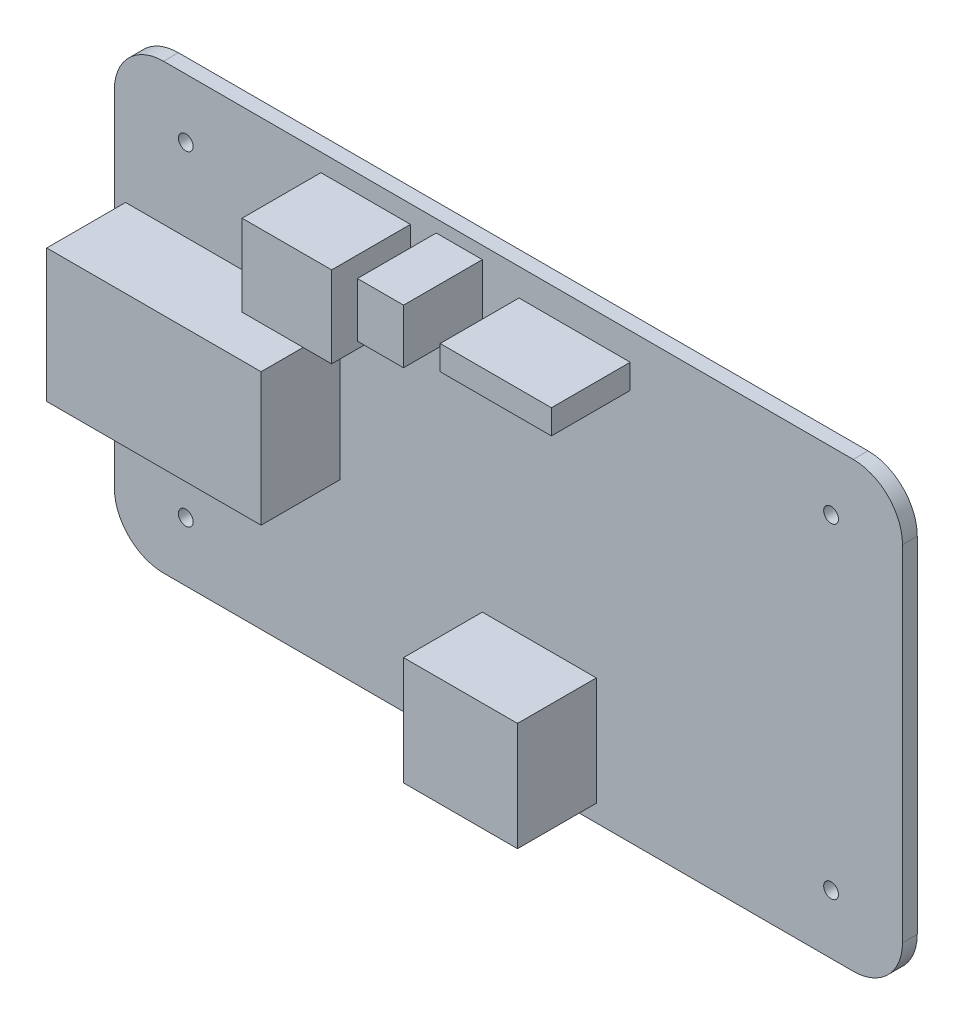
ISO-10303-21;
HEADER;
FILE_DESCRIPTION(('STEP AP214'),'2;1');
FILE_NAME('part.step','',(''),(''),'','','');
FILE_SCHEMA(('AUTOMOTIVE_DESIGN { 1 0 10303 214 1 1 1 1 }'));
ENDSEC;
DATA;
#1=APPLICATION_CONTEXT('core data for automotive mechanical design processes');
#2=APPLICATION_PROTOCOL_DEFINITION('international standard','automotive_design',2000,#1);
#3=PRODUCT_CONTEXT('',#1,'mechanical');
#4=PRODUCT('Part','Part','',(#3));
#5=PRODUCT_RELATED_PRODUCT_CATEGORY('part','',(#4));
#6=PRODUCT_DEFINITION_FORMATION('','',#4);
#7=PRODUCT_DEFINITION_CONTEXT('part definition',#1,'design');
#8=PRODUCT_DEFINITION('design','',#6,#7);
#9=PRODUCT_DEFINITION_SHAPE('','',#8);
#10=(LENGTH_UNIT() NAMED_UNIT(*) SI_UNIT(.MILLI.,.METRE.));
#11=(NAMED_UNIT(*) PLANE_ANGLE_UNIT() SI_UNIT($,.RADIAN.));
#12=(NAMED_UNIT(*) SI_UNIT($,.STERADIAN.) SOLID_ANGLE_UNIT());
#13=UNCERTAINTY_MEASURE_WITH_UNIT(LENGTH_MEASURE(1.E-05),#10,'distance_accuracy_value','');
#14=(GEOMETRIC_REPRESENTATION_CONTEXT(3) GLOBAL_UNCERTAINTY_ASSIGNED_CONTEXT((#13)) GLOBAL_UNIT_ASSIGNED_CONTEXT((#10,
#11,#12)) REPRESENTATION_CONTEXT('',''));
#15=CARTESIAN_POINT('',(0.,0.,0.));
#16=DIRECTION('',(0.,0.,1.));
#17=DIRECTION('',(1.,0.,0.));
#18=AXIS2_PLACEMENT_3D('',#15,#16,#17);
#19=CARTESIAN_POINT('',(0.,0.,3.));
#20=DIRECTION('',(0.,0.,1.));
#21=DIRECTION('',(1.,0.,0.));
#22=AXIS2_PLACEMENT_3D('',#19,#20,#21);
#23=PLANE('',#22);
#24=CARTESIAN_POINT('',(-65.5,-33.,3.));
#25=DIRECTION('',(0.,0.,1.));
#26=DIRECTION('',(1.,0.,0.));
#27=AXIS2_PLACEMENT_3D('',#24,#25,#26);
#28=CIRCLE('',#27,1.5);
#29=CARTESIAN_POINT('',(-64.,-33.,3.));
#30=VERTEX_POINT('',#29);
#31=EDGE_CURVE('E423',#30,#30,#28,.T.);
#32=ORIENTED_EDGE('',*,*,#31,.F.);
#33=EDGE_LOOP('',(#32));
#34=FACE_BOUND('',#33,.T.);
#35=CARTESIAN_POINT('',(65.5,-33.,3.));
#36=DIRECTION('',(0.,0.,1.));
#37=DIRECTION('',(1.,0.,0.));
#38=AXIS2_PLACEMENT_3D('',#35,#36,#37);
#39=CIRCLE('',#38,1.5);
#40=CARTESIAN_POINT('',(67.,-33.,3.));
#41=VERTEX_POINT('',#40);
#42=EDGE_CURVE('E437',#41,#41,#39,.T.);
#43=ORIENTED_EDGE('',*,*,#42,.F.);
#44=EDGE_LOOP('',(#43));
#45=FACE_BOUND('',#44,.T.);
#46=CARTESIAN_POINT('',(65.5,33.,3.));
#47=DIRECTION('',(0.,0.,1.));
#48=DIRECTION('',(1.,0.,0.));
#49=AXIS2_PLACEMENT_3D('',#46,#47,#48);
#50=CIRCLE('',#49,1.5);
#51=CARTESIAN_POINT('',(67.,33.,3.));
#52=VERTEX_POINT('',#51);
#53=EDGE_CURVE('E429',#52,#52,#50,.T.);
#54=ORIENTED_EDGE('',*,*,#53,.F.);
#55=EDGE_LOOP('',(#54));
#56=FACE_BOUND('',#55,.T.);
#57=CARTESIAN_POINT('',(-65.5,33.,3.));
#58=DIRECTION('',(0.,0.,1.));
#59=DIRECTION('',(1.,0.,0.));
#60=AXIS2_PLACEMENT_3D('',#57,#58,#59);
#61=CIRCLE('',#60,1.5);
#62=CARTESIAN_POINT('',(-64.,33.,3.));
#63=VERTEX_POINT('',#62);
#64=EDGE_CURVE('E428',#63,#63,#61,.T.);
#65=ORIENTED_EDGE('',*,*,#64,.F.);
#66=EDGE_LOOP('',(#65));
#67=FACE_BOUND('',#66,.T.);
#68=DIRECTION('',(0.,-1.,0.));
#69=VECTOR('',#68,1.);
#70=CARTESIAN_POINT('',(-80.,45.,3.));
#71=LINE('',#70,#69);
#72=CARTESIAN_POINT('',(-80.,35.,3.));
#73=VERTEX_POINT('',#72);
#74=CARTESIAN_POINT('',(-80.,-35.,3.));
#75=VERTEX_POINT('',#74);
#76=EDGE_CURVE('E465',#73,#75,#71,.T.);
#77=ORIENTED_EDGE('',*,*,#76,.T.);
#78=CARTESIAN_POINT('',(-70.,-35.,3.));
#79=DIRECTION('',(0.,0.,1.));
#80=DIRECTION('',(1.,0.,0.));
#81=AXIS2_PLACEMENT_3D('',#78,#79,#80);
#82=CIRCLE('',#81,10.);
#83=CARTESIAN_POINT('',(-70.,-45.,3.));
#84=VERTEX_POINT('',#83);
#85=EDGE_CURVE('E522',#75,#84,#82,.T.);
#86=ORIENTED_EDGE('',*,*,#85,.T.);
#87=DIRECTION('',(1.,0.,0.));
#88=VECTOR('',#87,1.);
#89=CARTESIAN_POINT('',(-80.,-45.,3.));
#90=LINE('',#89,#88);
#91=CARTESIAN_POINT('',(70.,-45.,3.));
#92=VERTEX_POINT('',#91);
#93=EDGE_CURVE('E469',#84,#92,#90,.T.);
#94=ORIENTED_EDGE('',*,*,#93,.T.);
#95=CARTESIAN_POINT('',(70.,-35.,3.));
#96=DIRECTION('',(0.,0.,1.));
#97=DIRECTION('',(1.,0.,0.));
#98=AXIS2_PLACEMENT_3D('',#95,#96,#97);
#99=CIRCLE('',#98,10.);
#100=CARTESIAN_POINT('',(80.,-35.,3.));
#101=VERTEX_POINT('',#100);
#102=EDGE_CURVE('E519',#92,#101,#99,.T.);
#103=ORIENTED_EDGE('',*,*,#102,.T.);
#104=DIRECTION('',(0.,1.,0.));
#105=VECTOR('',#104,1.);
#106=CARTESIAN_POINT('',(80.,45.,3.));
#107=LINE('',#106,#105);
#108=CARTESIAN_POINT('',(80.,35.,3.));
#109=VERTEX_POINT('',#108);
#110=EDGE_CURVE('E456',#101,#109,#107,.T.);
#111=ORIENTED_EDGE('',*,*,#110,.T.);
#112=CARTESIAN_POINT('',(70.,35.,3.));
#113=DIRECTION('',(0.,0.,1.));
#114=DIRECTION('',(1.,0.,0.));
#115=AXIS2_PLACEMENT_3D('',#112,#113,#114);
#116=CIRCLE('',#115,10.);
#117=CARTESIAN_POINT('',(70.,45.,3.));
#118=VERTEX_POINT('',#117);
#119=EDGE_CURVE('E516',#109,#118,#116,.T.);
#120=ORIENTED_EDGE('',*,*,#119,.T.);
#121=DIRECTION('',(-1.,0.,0.));
#122=VECTOR('',#121,1.);
#123=CARTESIAN_POINT('',(-80.,45.,3.));
#124=LINE('',#123,#122);
#125=CARTESIAN_POINT('',(-70.,45.,3.));
#126=VERTEX_POINT('',#125);
#127=EDGE_CURVE('E460',#118,#126,#124,.T.);
#128=ORIENTED_EDGE('',*,*,#127,.T.);
#129=CARTESIAN_POINT('',(-70.,35.,3.));
#130=DIRECTION('',(0.,0.,1.));
#131=DIRECTION('',(1.,0.,0.));
#132=AXIS2_PLACEMENT_3D('',#129,#130,#131);
#133=CIRCLE('',#132,10.);
#134=EDGE_CURVE('E513',#126,#73,#133,.T.);
#135=ORIENTED_EDGE('',*,*,#134,.T.);
#136=EDGE_LOOP('',(#77,#86,#94,#103,#111,#120,#128,#135));
#137=FACE_BOUND('',#136,.T.);
#138=DIRECTION('',(-1.,0.,0.));
#139=VECTOR('',#138,1.);
#140=CARTESIAN_POINT('',(-77.7255083528253,16.3109233428557,3.));
#141=LINE('',#140,#139);
#142=CARTESIAN_POINT('',(-34.2095907848696,16.3109233428557,3.));
#143=VERTEX_POINT('',#142);
#144=CARTESIAN_POINT('',(-77.7255083528253,16.3109233428557,3.));
#145=VERTEX_POINT('',#144);
#146=EDGE_CURVE('E401',#143,#145,#141,.T.);
#147=ORIENTED_EDGE('',*,*,#146,.F.);
#148=DIRECTION('',(0.,1.,0.));
#149=VECTOR('',#148,1.);
#150=CARTESIAN_POINT('',(-34.2095907848696,16.3109233428557,3.));
#151=LINE('',#150,#149);
#152=CARTESIAN_POINT('',(-34.2095907848696,-10.6799622372687,3.));
#153=VERTEX_POINT('',#152);
#154=EDGE_CURVE('E382',#153,#143,#151,.T.);
#155=ORIENTED_EDGE('',*,*,#154,.F.);
#156=DIRECTION('',(1.,0.,0.));
#157=VECTOR('',#156,1.);
#158=CARTESIAN_POINT('',(-77.7255083528253,-10.6799622372687,3.));
#159=LINE('',#158,#157);
#160=CARTESIAN_POINT('',(-77.7255083528253,-10.6799622372687,3.));
#161=VERTEX_POINT('',#160);
#162=EDGE_CURVE('E388',#161,#153,#159,.T.);
#163=ORIENTED_EDGE('',*,*,#162,.F.);
#164=DIRECTION('',(0.,-1.,0.));
#165=VECTOR('',#164,1.);
#166=CARTESIAN_POINT('',(-77.7255083528253,16.3109233428557,3.));
#167=LINE('',#166,#165);
#168=EDGE_CURVE('E404',#145,#161,#167,.T.);
#169=ORIENTED_EDGE('',*,*,#168,.F.);
#170=EDGE_LOOP('',(#147,#155,#163,#169));
#171=FACE_BOUND('',#170,.T.);
#172=DIRECTION('',(-1.,0.,0.));
#173=VECTOR('',#172,1.);
#174=CARTESIAN_POINT('',(-5.29078480616496,-19.4933126307787,3.));
#175=LINE('',#174,#173);
#176=CARTESIAN_POINT('',(17.8442599767988,-19.4933126307787,3.));
#177=VERTEX_POINT('',#176);
#178=CARTESIAN_POINT('',(-5.29078480616496,-19.4933126307787,3.));
#179=VERTEX_POINT('',#178);
#180=EDGE_CURVE('E360',#177,#179,#175,.T.);
#181=ORIENTED_EDGE('',*,*,#180,.F.);
#182=DIRECTION('',(0.,1.,0.));
#183=VECTOR('',#182,1.);
#184=CARTESIAN_POINT('',(17.8442599767988,-19.4933126307787,3.));
#185=LINE('',#184,#183);
#186=CARTESIAN_POINT('',(17.8442599767988,-41.5266886145537,3.));
#187=VERTEX_POINT('',#186);
#188=EDGE_CURVE('E341',#187,#177,#185,.T.);
#189=ORIENTED_EDGE('',*,*,#188,.F.);
#190=DIRECTION('',(1.,0.,0.));
#191=VECTOR('',#190,1.);
#192=CARTESIAN_POINT('',(-5.29078480616496,-41.5266886145537,3.));
#193=LINE('',#192,#191);
#194=CARTESIAN_POINT('',(-5.29078480616496,-41.5266886145537,3.));
#195=VERTEX_POINT('',#194);
#196=EDGE_CURVE('E347',#195,#187,#193,.T.);
#197=ORIENTED_EDGE('',*,*,#196,.F.);
#198=DIRECTION('',(0.,-1.,0.));
#199=VECTOR('',#198,1.);
#200=CARTESIAN_POINT('',(-5.29078480616496,-19.4933126307787,3.));
#201=LINE('',#200,#199);
#202=EDGE_CURVE('E363',#179,#195,#201,.T.);
#203=ORIENTED_EDGE('',*,*,#202,.F.);
#204=EDGE_LOOP('',(#181,#189,#197,#203));
#205=FACE_BOUND('',#204,.T.);
#206=DIRECTION('',(-1.,0.,0.));
#207=VECTOR('',#206,1.);
#208=CARTESIAN_POINT('',(-38.0654315820302,41.3738885243998,3.));
#209=LINE('',#208,#207);
#210=CARTESIAN_POINT('',(-19.8878963954159,41.3738885243998,3.));
#211=VERTEX_POINT('',#210);
#212=CARTESIAN_POINT('',(-38.0654315820302,41.3738885243998,3.));
#213=VERTEX_POINT('',#212);
#214=EDGE_CURVE('E319',#211,#213,#209,.T.);
#215=ORIENTED_EDGE('',*,*,#214,.F.);
#216=DIRECTION('',(0.,1.,0.));
#217=VECTOR('',#216,1.);
#218=CARTESIAN_POINT('',(-19.8878963954159,41.3738885243998,3.));
#219=LINE('',#218,#217);
#220=CARTESIAN_POINT('',(-19.8878963954159,24.8488565365685,3.));
#221=VERTEX_POINT('',#220);
#222=EDGE_CURVE('E300',#221,#211,#219,.T.);
#223=ORIENTED_EDGE('',*,*,#222,.F.);
#224=DIRECTION('',(1.,0.,0.));
#225=VECTOR('',#224,1.);
#226=CARTESIAN_POINT('',(-38.0654315820302,24.8488565365685,3.));
#227=LINE('',#226,#225);
#228=CARTESIAN_POINT('',(-38.0654315820302,24.8488565365685,3.));
#229=VERTEX_POINT('',#228);
#230=EDGE_CURVE('E306',#229,#221,#227,.T.);
#231=ORIENTED_EDGE('',*,*,#230,.F.);
#232=DIRECTION('',(0.,-1.,0.));
#233=VECTOR('',#232,1.);
#234=CARTESIAN_POINT('',(-38.0654315820302,41.3738885243998,3.));
#235=LINE('',#234,#233);
#236=EDGE_CURVE('E322',#213,#229,#235,.T.);
#237=ORIENTED_EDGE('',*,*,#236,.F.);
#238=EDGE_LOOP('',(#215,#223,#231,#237));
#239=FACE_BOUND('',#238,.T.);
#240=DIRECTION('',(-1.,0.,0.));
#241=VECTOR('',#240,1.);
#242=CARTESIAN_POINT('',(-14.6549695992693,42.4755573235885,3.));
#243=LINE('',#242,#241);
#244=CARTESIAN_POINT('',(-5.29078480616496,42.4755573235885,3.));
#245=VERTEX_POINT('',#244);
#246=CARTESIAN_POINT('',(-14.6549695992693,42.4755573235885,3.));
#247=VERTEX_POINT('',#246);
#248=EDGE_CURVE('E261',#245,#247,#243,.T.);
#249=ORIENTED_EDGE('',*,*,#248,.F.);
#250=DIRECTION('',(0.,1.,0.));
#251=VECTOR('',#250,1.);
#252=CARTESIAN_POINT('',(-5.29078480616496,42.4755573235885,3.));
#253=LINE('',#252,#251);
#254=CARTESIAN_POINT('',(-5.29078480616496,31.458869331701,3.));
#255=VERTEX_POINT('',#254);
#256=EDGE_CURVE('E256',#255,#245,#253,.T.);
#257=ORIENTED_EDGE('',*,*,#256,.F.);
#258=DIRECTION('',(1.,0.,0.));
#259=VECTOR('',#258,1.);
#260=CARTESIAN_POINT('',(-14.6549695992693,31.458869331701,3.));
#261=LINE('',#260,#259);
#262=CARTESIAN_POINT('',(-14.6549695992693,31.458869331701,3.));
#263=VERTEX_POINT('',#262);
#264=EDGE_CURVE('E271',#263,#255,#261,.T.);
#265=ORIENTED_EDGE('',*,*,#264,.F.);
#266=DIRECTION('',(0.,-1.,0.));
#267=VECTOR('',#266,1.);
#268=CARTESIAN_POINT('',(-14.6549695992693,42.4755573235885,3.));
#269=LINE('',#268,#267);
#270=EDGE_CURVE('E283',#247,#263,#269,.T.);
#271=ORIENTED_EDGE('',*,*,#270,.F.);
#272=EDGE_LOOP('',(#249,#257,#265,#271));
#273=FACE_BOUND('',#272,.T.);
#274=DIRECTION('',(-1.,0.,0.));
#275=VECTOR('',#274,1.);
#276=CARTESIAN_POINT('',(2.14547958835909,39.4459681258195,3.));
#277=LINE('',#276,#275);
#278=CARTESIAN_POINT('',(24.7296899717285,39.4459681258195,3.));
#279=VERTEX_POINT('',#278);
#280=CARTESIAN_POINT('',(2.14547958835909,39.4459681258195,3.));
#281=VERTEX_POINT('',#280);
#282=EDGE_CURVE('E917',#279,#281,#277,.T.);
#283=ORIENTED_EDGE('',*,*,#282,.F.);
#284=DIRECTION('',(0.,1.,0.));
#285=VECTOR('',#284,1.);
#286=CARTESIAN_POINT('',(24.7296899717285,34.4884585294701,3.));
#287=LINE('',#286,#285);
#288=CARTESIAN_POINT('',(24.7296899717285,34.4884585294701,3.));
#289=VERTEX_POINT('',#288);
#290=EDGE_CURVE('E253',#289,#279,#287,.T.);
#291=ORIENTED_EDGE('',*,*,#290,.F.);
#292=DIRECTION('',(1.,0.,0.));
#293=VECTOR('',#292,1.);
#294=CARTESIAN_POINT('',(2.14547958835909,34.4884585294701,3.));
#295=LINE('',#294,#293);
#296=CARTESIAN_POINT('',(2.14547958835909,34.4884585294701,3.));
#297=VERTEX_POINT('',#296);
#298=EDGE_CURVE('E249',#297,#289,#295,.T.);
#299=ORIENTED_EDGE('',*,*,#298,.F.);
#300=DIRECTION('',(0.,-1.,0.));
#301=VECTOR('',#300,1.);
#302=CARTESIAN_POINT('',(2.14547958835909,34.4884585294701,3.));
#303=LINE('',#302,#301);
#304=EDGE_CURVE('E913',#281,#297,#303,.T.);
#305=ORIENTED_EDGE('',*,*,#304,.F.);
#306=EDGE_LOOP('',(#283,#291,#299,#305));
#307=FACE_BOUND('',#306,.T.);
#308=ADVANCED_FACE('F41',(#34,#45,#56,#67,#137,#171,#205,#239,#273,#307),#23,.T.);
#309=CARTESIAN_POINT('',(80.,45.,3.));
#310=DIRECTION('',(-1.,0.,0.));
#311=DIRECTION('',(0.,0.,1.));
#312=AXIS2_PLACEMENT_3D('',#309,#310,#311);
#313=PLANE('',#312);
#314=ORIENTED_EDGE('',*,*,#110,.F.);
#315=DIRECTION('',(0.,0.,-1.));
#316=VECTOR('',#315,1.);
#317=CARTESIAN_POINT('',(80.,-35.,3.));
#318=LINE('',#317,#316);
#319=CARTESIAN_POINT('',(80.,-35.,0.));
#320=VERTEX_POINT('',#319);
#321=EDGE_CURVE('E528',#101,#320,#318,.T.);
#322=ORIENTED_EDGE('',*,*,#321,.T.);
#323=DIRECTION('',(0.,1.,0.));
#324=VECTOR('',#323,1.);
#325=CARTESIAN_POINT('',(80.,45.,0.));
#326=LINE('',#325,#324);
#327=CARTESIAN_POINT('',(80.,35.,0.));
#328=VERTEX_POINT('',#327);
#329=EDGE_CURVE('E452',#320,#328,#326,.T.);
#330=ORIENTED_EDGE('',*,*,#329,.T.);
#331=DIRECTION('',(0.,0.,-1.));
#332=VECTOR('',#331,1.);
#333=CARTESIAN_POINT('',(80.,35.,3.));
#334=LINE('',#333,#332);
#335=EDGE_CURVE('E525',#328,#109,#334,.F.);
#336=ORIENTED_EDGE('',*,*,#335,.T.);
#337=EDGE_LOOP('',(#314,#322,#330,#336));
#338=FACE_BOUND('',#337,.T.);
#339=ADVANCED_FACE('F567',(#338),#313,.F.);
#340=CARTESIAN_POINT('',(-80.,45.,3.));
#341=DIRECTION('',(0.,-1.,0.));
#342=DIRECTION('',(0.,0.,-1.));
#343=AXIS2_PLACEMENT_3D('',#340,#341,#342);
#344=PLANE('',#343);
#345=ORIENTED_EDGE('',*,*,#127,.F.);
#346=DIRECTION('',(0.,0.,-1.));
#347=VECTOR('',#346,1.);
#348=CARTESIAN_POINT('',(70.,45.,3.));
#349=LINE('',#348,#347);
#350=CARTESIAN_POINT('',(70.,45.,0.));
#351=VERTEX_POINT('',#350);
#352=EDGE_CURVE('E11',#118,#351,#349,.T.);
#353=ORIENTED_EDGE('',*,*,#352,.T.);
#354=DIRECTION('',(-1.,0.,0.));
#355=VECTOR('',#354,1.);
#356=CARTESIAN_POINT('',(-80.,45.,0.));
#357=LINE('',#356,#355);
#358=CARTESIAN_POINT('',(-70.,45.,0.));
#359=VERTEX_POINT('',#358);
#360=EDGE_CURVE('E477',#351,#359,#357,.T.);
#361=ORIENTED_EDGE('',*,*,#360,.T.);
#362=DIRECTION('',(0.,0.,-1.));
#363=VECTOR('',#362,1.);
#364=CARTESIAN_POINT('',(-70.,45.,3.));
#365=LINE('',#364,#363);
#366=EDGE_CURVE('E50',#359,#126,#365,.F.);
#367=ORIENTED_EDGE('',*,*,#366,.T.);
#368=EDGE_LOOP('',(#345,#353,#361,#367));
#369=FACE_BOUND('',#368,.T.);
#370=ADVANCED_FACE('F535',(#369),#344,.F.);
#371=CARTESIAN_POINT('',(-80.,45.,3.));
#372=DIRECTION('',(1.,0.,0.));
#373=DIRECTION('',(0.,1.,0.));
#374=AXIS2_PLACEMENT_3D('',#371,#372,#373);
#375=PLANE('',#374);
#376=DIRECTION('',(0.,-1.,0.));
#377=VECTOR('',#376,1.);
#378=CARTESIAN_POINT('',(-80.,45.,0.));
#379=LINE('',#378,#377);
#380=CARTESIAN_POINT('',(-80.,35.,0.));
#381=VERTEX_POINT('',#380);
#382=CARTESIAN_POINT('',(-80.,-35.,0.));
#383=VERTEX_POINT('',#382);
#384=EDGE_CURVE('E481',#381,#383,#379,.T.);
#385=ORIENTED_EDGE('',*,*,#384,.T.);
#386=DIRECTION('',(0.,0.,-1.));
#387=VECTOR('',#386,1.);
#388=CARTESIAN_POINT('',(-80.,-35.,3.));
#389=LINE('',#388,#387);
#390=EDGE_CURVE('E510',#383,#75,#389,.F.);
#391=ORIENTED_EDGE('',*,*,#390,.T.);
#392=ORIENTED_EDGE('',*,*,#76,.F.);
#393=DIRECTION('',(0.,0.,-1.));
#394=VECTOR('',#393,1.);
#395=CARTESIAN_POINT('',(-80.,35.,3.));
#396=LINE('',#395,#394);
#397=EDGE_CURVE('E506',#73,#381,#396,.T.);
#398=ORIENTED_EDGE('',*,*,#397,.T.);
#399=EDGE_LOOP('',(#385,#391,#392,#398));
#400=FACE_BOUND('',#399,.T.);
#401=ADVANCED_FACE('F547',(#400),#375,.F.);
#402=CARTESIAN_POINT('',(-80.,-45.,3.));
#403=DIRECTION('',(0.,1.,0.));
#404=DIRECTION('',(0.,0.,1.));
#405=AXIS2_PLACEMENT_3D('',#402,#403,#404);
#406=PLANE('',#405);
#407=ORIENTED_EDGE('',*,*,#93,.F.);
#408=DIRECTION('',(0.,0.,-1.));
#409=VECTOR('',#408,1.);
#410=CARTESIAN_POINT('',(-70.,-45.,3.));
#411=LINE('',#410,#409);
#412=CARTESIAN_POINT('',(-70.,-45.,0.));
#413=VERTEX_POINT('',#412);
#414=EDGE_CURVE('E490',#84,#413,#411,.T.);
#415=ORIENTED_EDGE('',*,*,#414,.T.);
#416=DIRECTION('',(1.,0.,0.));
#417=VECTOR('',#416,1.);
#418=CARTESIAN_POINT('',(-80.,-45.,0.));
#419=LINE('',#418,#417);
#420=CARTESIAN_POINT('',(70.,-45.,0.));
#421=VERTEX_POINT('',#420);
#422=EDGE_CURVE('E461',#413,#421,#419,.T.);
#423=ORIENTED_EDGE('',*,*,#422,.T.);
#424=DIRECTION('',(0.,0.,-1.));
#425=VECTOR('',#424,1.);
#426=CARTESIAN_POINT('',(70.,-45.,3.));
#427=LINE('',#426,#425);
#428=EDGE_CURVE('E473',#421,#92,#427,.F.);
#429=ORIENTED_EDGE('',*,*,#428,.T.);
#430=EDGE_LOOP('',(#407,#415,#423,#429));
#431=FACE_BOUND('',#430,.T.);
#432=ADVANCED_FACE('F558',(#431),#406,.F.);
#433=CARTESIAN_POINT('',(0.,0.,0.));
#434=DIRECTION('',(0.,0.,1.));
#435=DIRECTION('',(1.,0.,0.));
#436=AXIS2_PLACEMENT_3D('',#433,#434,#435);
#437=PLANE('',#436);
#438=CARTESIAN_POINT('',(-65.5,-33.,0.));
#439=DIRECTION('',(0.,0.,1.));
#440=DIRECTION('',(1.,0.,0.));
#441=AXIS2_PLACEMENT_3D('',#438,#439,#440);
#442=CIRCLE('',#441,1.5);
#443=CARTESIAN_POINT('',(-64.,-33.,0.));
#444=VERTEX_POINT('',#443);
#445=EDGE_CURVE('E441',#444,#444,#442,.T.);
#446=ORIENTED_EDGE('',*,*,#445,.T.);
#447=EDGE_LOOP('',(#446));
#448=FACE_BOUND('',#447,.T.);
#449=CARTESIAN_POINT('',(65.5,-33.,0.));
#450=DIRECTION('',(0.,0.,1.));
#451=DIRECTION('',(1.,0.,0.));
#452=AXIS2_PLACEMENT_3D('',#449,#450,#451);
#453=CIRCLE('',#452,1.5);
#454=CARTESIAN_POINT('',(67.,-33.,0.));
#455=VERTEX_POINT('',#454);
#456=EDGE_CURVE('E433',#455,#455,#453,.T.);
#457=ORIENTED_EDGE('',*,*,#456,.T.);
#458=EDGE_LOOP('',(#457));
#459=FACE_BOUND('',#458,.T.);
#460=CARTESIAN_POINT('',(65.5,33.,0.));
#461=DIRECTION('',(0.,0.,1.));
#462=DIRECTION('',(1.,0.,0.));
#463=AXIS2_PLACEMENT_3D('',#460,#461,#462);
#464=CIRCLE('',#463,1.5);
#465=CARTESIAN_POINT('',(67.,33.,0.));
#466=VERTEX_POINT('',#465);
#467=EDGE_CURVE('E424',#466,#466,#464,.T.);
#468=ORIENTED_EDGE('',*,*,#467,.T.);
#469=EDGE_LOOP('',(#468));
#470=FACE_BOUND('',#469,.T.);
#471=CARTESIAN_POINT('',(-65.5,33.,0.));
#472=DIRECTION('',(0.,0.,1.));
#473=DIRECTION('',(1.,0.,0.));
#474=AXIS2_PLACEMENT_3D('',#471,#472,#473);
#475=CIRCLE('',#474,1.5);
#476=CARTESIAN_POINT('',(-64.,33.,0.));
#477=VERTEX_POINT('',#476);
#478=EDGE_CURVE('E448',#477,#477,#475,.T.);
#479=ORIENTED_EDGE('',*,*,#478,.T.);
#480=EDGE_LOOP('',(#479));
#481=FACE_BOUND('',#480,.T.);
#482=ORIENTED_EDGE('',*,*,#422,.F.);
#483=CARTESIAN_POINT('',(-70.,-35.,0.));
#484=DIRECTION('',(0.,0.,1.));
#485=DIRECTION('',(1.,0.,0.));
#486=AXIS2_PLACEMENT_3D('',#483,#484,#485);
#487=CIRCLE('',#486,10.);
#488=EDGE_CURVE('E503',#413,#383,#487,.F.);
#489=ORIENTED_EDGE('',*,*,#488,.T.);
#490=ORIENTED_EDGE('',*,*,#384,.F.);
#491=CARTESIAN_POINT('',(-70.,35.,0.));
#492=DIRECTION('',(0.,0.,1.));
#493=DIRECTION('',(1.,0.,0.));
#494=AXIS2_PLACEMENT_3D('',#491,#492,#493);
#495=CIRCLE('',#494,10.);
#496=EDGE_CURVE('E494',#381,#359,#495,.F.);
#497=ORIENTED_EDGE('',*,*,#496,.T.);
#498=ORIENTED_EDGE('',*,*,#360,.F.);
#499=CARTESIAN_POINT('',(70.,35.,0.));
#500=DIRECTION('',(0.,0.,1.));
#501=DIRECTION('',(1.,0.,0.));
#502=AXIS2_PLACEMENT_3D('',#499,#500,#501);
#503=CIRCLE('',#502,10.);
#504=EDGE_CURVE('E497',#351,#328,#503,.F.);
#505=ORIENTED_EDGE('',*,*,#504,.T.);
#506=ORIENTED_EDGE('',*,*,#329,.F.);
#507=CARTESIAN_POINT('',(70.,-35.,0.));
#508=DIRECTION('',(0.,0.,1.));
#509=DIRECTION('',(1.,0.,0.));
#510=AXIS2_PLACEMENT_3D('',#507,#508,#509);
#511=CIRCLE('',#510,10.);
#512=EDGE_CURVE('E500',#320,#421,#511,.F.);
#513=ORIENTED_EDGE('',*,*,#512,.T.);
#514=EDGE_LOOP('',(#482,#489,#490,#497,#498,#505,#506,#513));
#515=FACE_BOUND('',#514,.T.);
#516=ADVANCED_FACE('F551',(#448,#459,#470,#481,#515),#437,.F.);
#517=CARTESIAN_POINT('',(-70.,-35.,3.));
#518=DIRECTION('',(0.,0.,-1.));
#519=DIRECTION('',(-1.,0.,0.));
#520=AXIS2_PLACEMENT_3D('',#517,#518,#519);
#521=CYLINDRICAL_SURFACE('',#520,10.);
#522=ORIENTED_EDGE('',*,*,#85,.F.);
#523=ORIENTED_EDGE('',*,*,#390,.F.);
#524=ORIENTED_EDGE('',*,*,#488,.F.);
#525=ORIENTED_EDGE('',*,*,#414,.F.);
#526=EDGE_LOOP('',(#522,#523,#524,#525));
#527=FACE_BOUND('',#526,.T.);
#528=ADVANCED_FACE('F555',(#527),#521,.T.);
#529=CARTESIAN_POINT('',(70.,-35.,3.));
#530=DIRECTION('',(0.,0.,-1.));
#531=DIRECTION('',(-1.,0.,0.));
#532=AXIS2_PLACEMENT_3D('',#529,#530,#531);
#533=CYLINDRICAL_SURFACE('',#532,10.);
#534=ORIENTED_EDGE('',*,*,#102,.F.);
#535=ORIENTED_EDGE('',*,*,#428,.F.);
#536=ORIENTED_EDGE('',*,*,#512,.F.);
#537=ORIENTED_EDGE('',*,*,#321,.F.);
#538=EDGE_LOOP('',(#534,#535,#536,#537));
#539=FACE_BOUND('',#538,.T.);
#540=ADVANCED_FACE('F564',(#539),#533,.T.);
#541=CARTESIAN_POINT('',(70.,35.,3.));
#542=DIRECTION('',(0.,0.,-1.));
#543=DIRECTION('',(-1.,0.,0.));
#544=AXIS2_PLACEMENT_3D('',#541,#542,#543);
#545=CYLINDRICAL_SURFACE('',#544,10.);
#546=ORIENTED_EDGE('',*,*,#119,.F.);
#547=ORIENTED_EDGE('',*,*,#335,.F.);
#548=ORIENTED_EDGE('',*,*,#504,.F.);
#549=ORIENTED_EDGE('',*,*,#352,.F.);
#550=EDGE_LOOP('',(#546,#547,#548,#549));
#551=FACE_BOUND('',#550,.T.);
#552=ADVANCED_FACE('F570',(#551),#545,.T.);
#553=CARTESIAN_POINT('',(-70.,35.,3.));
#554=DIRECTION('',(0.,0.,-1.));
#555=DIRECTION('',(-1.,0.,0.));
#556=AXIS2_PLACEMENT_3D('',#553,#554,#555);
#557=CYLINDRICAL_SURFACE('',#556,10.);
#558=ORIENTED_EDGE('',*,*,#134,.F.);
#559=ORIENTED_EDGE('',*,*,#366,.F.);
#560=ORIENTED_EDGE('',*,*,#496,.F.);
#561=ORIENTED_EDGE('',*,*,#397,.F.);
#562=EDGE_LOOP('',(#558,#559,#560,#561));
#563=FACE_BOUND('',#562,.T.);
#564=ADVANCED_FACE('F43',(#563),#557,.T.);
#565=CARTESIAN_POINT('',(-65.5,33.,0.));
#566=DIRECTION('',(0.,0.,1.));
#567=DIRECTION('',(1.,0.,0.));
#568=AXIS2_PLACEMENT_3D('',#565,#566,#567);
#569=CYLINDRICAL_SURFACE('',#568,1.5);
#570=ORIENTED_EDGE('',*,*,#478,.F.);
#571=EDGE_LOOP('',(#570));
#572=FACE_BOUND('',#571,.T.);
#573=ORIENTED_EDGE('',*,*,#64,.T.);
#574=EDGE_LOOP('',(#573));
#575=FACE_BOUND('',#574,.T.);
#576=ADVANCED_FACE('F576',(#572,#575),#569,.F.);
#577=CARTESIAN_POINT('',(65.5,33.,0.));
#578=DIRECTION('',(0.,0.,1.));
#579=DIRECTION('',(1.,0.,0.));
#580=AXIS2_PLACEMENT_3D('',#577,#578,#579);
#581=CYLINDRICAL_SURFACE('',#580,1.5);
#582=ORIENTED_EDGE('',*,*,#467,.F.);
#583=EDGE_LOOP('',(#582));
#584=FACE_BOUND('',#583,.T.);
#585=ORIENTED_EDGE('',*,*,#53,.T.);
#586=EDGE_LOOP('',(#585));
#587=FACE_BOUND('',#586,.T.);
#588=ADVANCED_FACE('F632',(#584,#587),#581,.F.);
#589=CARTESIAN_POINT('',(65.5,-33.,0.));
#590=DIRECTION('',(0.,0.,1.));
#591=DIRECTION('',(1.,0.,0.));
#592=AXIS2_PLACEMENT_3D('',#589,#590,#591);
#593=CYLINDRICAL_SURFACE('',#592,1.5);
#594=ORIENTED_EDGE('',*,*,#456,.F.);
#595=EDGE_LOOP('',(#594));
#596=FACE_BOUND('',#595,.T.);
#597=ORIENTED_EDGE('',*,*,#42,.T.);
#598=EDGE_LOOP('',(#597));
#599=FACE_BOUND('',#598,.T.);
#600=ADVANCED_FACE('F641',(#596,#599),#593,.F.);
#601=CARTESIAN_POINT('',(-65.5,-33.,0.));
#602=DIRECTION('',(0.,0.,1.));
#603=DIRECTION('',(1.,0.,0.));
#604=AXIS2_PLACEMENT_3D('',#601,#602,#603);
#605=CYLINDRICAL_SURFACE('',#604,1.5);
#606=ORIENTED_EDGE('',*,*,#445,.F.);
#607=EDGE_LOOP('',(#606));
#608=FACE_BOUND('',#607,.T.);
#609=ORIENTED_EDGE('',*,*,#31,.T.);
#610=EDGE_LOOP('',(#609));
#611=FACE_BOUND('',#610,.T.);
#612=ADVANCED_FACE('F650',(#608,#611),#605,.F.);
#613=CARTESIAN_POINT('',(-34.2095907848696,16.3109233428557,19.));
#614=DIRECTION('',(-1.,0.,0.));
#615=DIRECTION('',(0.,0.,1.));
#616=AXIS2_PLACEMENT_3D('',#613,#614,#615);
#617=PLANE('',#616);
#618=ORIENTED_EDGE('',*,*,#154,.T.);
#619=DIRECTION('',(0.,0.,-1.));
#620=VECTOR('',#619,1.);
#621=CARTESIAN_POINT('',(-34.2095907848696,16.3109233428557,19.));
#622=LINE('',#621,#620);
#623=CARTESIAN_POINT('',(-34.2095907848696,16.3109233428557,19.));
#624=VERTEX_POINT('',#623);
#625=EDGE_CURVE('E420',#624,#143,#622,.T.);
#626=ORIENTED_EDGE('',*,*,#625,.F.);
#627=DIRECTION('',(0.,1.,0.));
#628=VECTOR('',#627,1.);
#629=CARTESIAN_POINT('',(-34.2095907848696,16.3109233428557,19.));
#630=LINE('',#629,#628);
#631=CARTESIAN_POINT('',(-34.2095907848696,-10.6799622372687,19.));
#632=VERTEX_POINT('',#631);
#633=EDGE_CURVE('E383',#632,#624,#630,.T.);
#634=ORIENTED_EDGE('',*,*,#633,.F.);
#635=DIRECTION('',(0.,0.,-1.));
#636=VECTOR('',#635,1.);
#637=CARTESIAN_POINT('',(-34.2095907848696,-10.6799622372687,19.));
#638=LINE('',#637,#636);
#639=EDGE_CURVE('E397',#632,#153,#638,.T.);
#640=ORIENTED_EDGE('',*,*,#639,.T.);
#641=EDGE_LOOP('',(#618,#626,#634,#640));
#642=FACE_BOUND('',#641,.T.);
#643=ADVANCED_FACE('F659',(#642),#617,.F.);
#644=CARTESIAN_POINT('',(-77.7255083528253,16.3109233428557,19.));
#645=DIRECTION('',(0.,-1.,0.));
#646=DIRECTION('',(0.,0.,-1.));
#647=AXIS2_PLACEMENT_3D('',#644,#645,#646);
#648=PLANE('',#647);
#649=ORIENTED_EDGE('',*,*,#146,.T.);
#650=DIRECTION('',(0.,0.,-1.));
#651=VECTOR('',#650,1.);
#652=CARTESIAN_POINT('',(-77.7255083528253,16.3109233428557,19.));
#653=LINE('',#652,#651);
#654=CARTESIAN_POINT('',(-77.7255083528253,16.3109233428557,19.));
#655=VERTEX_POINT('',#654);
#656=EDGE_CURVE('E416',#655,#145,#653,.T.);
#657=ORIENTED_EDGE('',*,*,#656,.F.);
#658=DIRECTION('',(-1.,0.,0.));
#659=VECTOR('',#658,1.);
#660=CARTESIAN_POINT('',(-77.7255083528253,16.3109233428557,19.));
#661=LINE('',#660,#659);
#662=EDGE_CURVE('E387',#624,#655,#661,.T.);
#663=ORIENTED_EDGE('',*,*,#662,.F.);
#664=ORIENTED_EDGE('',*,*,#625,.T.);
#665=EDGE_LOOP('',(#649,#657,#663,#664));
#666=FACE_BOUND('',#665,.T.);
#667=ADVANCED_FACE('F672',(#666),#648,.F.);
#668=CARTESIAN_POINT('',(-77.7255083528253,16.3109233428557,19.));
#669=DIRECTION('',(1.,0.,0.));
#670=DIRECTION('',(0.,0.,-1.));
#671=AXIS2_PLACEMENT_3D('',#668,#669,#670);
#672=PLANE('',#671);
#673=ORIENTED_EDGE('',*,*,#168,.T.);
#674=DIRECTION('',(0.,0.,-1.));
#675=VECTOR('',#674,1.);
#676=CARTESIAN_POINT('',(-77.7255083528253,-10.6799622372687,19.));
#677=LINE('',#676,#675);
#678=CARTESIAN_POINT('',(-77.7255083528253,-10.6799622372687,19.));
#679=VERTEX_POINT('',#678);
#680=EDGE_CURVE('E413',#679,#161,#677,.T.);
#681=ORIENTED_EDGE('',*,*,#680,.F.);
#682=DIRECTION('',(0.,-1.,0.));
#683=VECTOR('',#682,1.);
#684=CARTESIAN_POINT('',(-77.7255083528253,16.3109233428557,19.));
#685=LINE('',#684,#683);
#686=EDGE_CURVE('E391',#655,#679,#685,.T.);
#687=ORIENTED_EDGE('',*,*,#686,.F.);
#688=ORIENTED_EDGE('',*,*,#656,.T.);
#689=EDGE_LOOP('',(#673,#681,#687,#688));
#690=FACE_BOUND('',#689,.T.);
#691=ADVANCED_FACE('F679',(#690),#672,.F.);
#692=CARTESIAN_POINT('',(-77.7255083528253,-10.6799622372687,19.));
#693=DIRECTION('',(0.,1.,0.));
#694=DIRECTION('',(0.,0.,1.));
#695=AXIS2_PLACEMENT_3D('',#692,#693,#694);
#696=PLANE('',#695);
#697=ORIENTED_EDGE('',*,*,#162,.T.);
#698=ORIENTED_EDGE('',*,*,#639,.F.);
#699=DIRECTION('',(1.,0.,0.));
#700=VECTOR('',#699,1.);
#701=CARTESIAN_POINT('',(-77.7255083528253,-10.6799622372687,19.));
#702=LINE('',#701,#700);
#703=EDGE_CURVE('E394',#679,#632,#702,.T.);
#704=ORIENTED_EDGE('',*,*,#703,.F.);
#705=ORIENTED_EDGE('',*,*,#680,.T.);
#706=EDGE_LOOP('',(#697,#698,#704,#705));
#707=FACE_BOUND('',#706,.T.);
#708=ADVANCED_FACE('F687',(#707),#696,.F.);
#709=CARTESIAN_POINT('',(0.,0.,19.));
#710=DIRECTION('',(0.,0.,1.));
#711=DIRECTION('',(1.,0.,0.));
#712=AXIS2_PLACEMENT_3D('',#709,#710,#711);
#713=PLANE('',#712);
#714=ORIENTED_EDGE('',*,*,#633,.T.);
#715=ORIENTED_EDGE('',*,*,#662,.T.);
#716=ORIENTED_EDGE('',*,*,#686,.T.);
#717=ORIENTED_EDGE('',*,*,#703,.T.);
#718=EDGE_LOOP('',(#714,#715,#716,#717));
#719=FACE_BOUND('',#718,.T.);
#720=ADVANCED_FACE('F695',(#719),#713,.T.);
#721=CARTESIAN_POINT('',(17.8442599767988,-19.4933126307787,19.));
#722=DIRECTION('',(-1.,0.,0.));
#723=DIRECTION('',(0.,0.,1.));
#724=AXIS2_PLACEMENT_3D('',#721,#722,#723);
#725=PLANE('',#724);
#726=ORIENTED_EDGE('',*,*,#188,.T.);
#727=DIRECTION('',(0.,0.,-1.));
#728=VECTOR('',#727,1.);
#729=CARTESIAN_POINT('',(17.8442599767988,-19.4933126307787,19.));
#730=LINE('',#729,#728);
#731=CARTESIAN_POINT('',(17.8442599767988,-19.4933126307787,19.));
#732=VERTEX_POINT('',#731);
#733=EDGE_CURVE('E379',#732,#177,#730,.T.);
#734=ORIENTED_EDGE('',*,*,#733,.F.);
#735=DIRECTION('',(0.,1.,0.));
#736=VECTOR('',#735,1.);
#737=CARTESIAN_POINT('',(17.8442599767988,-19.4933126307787,19.));
#738=LINE('',#737,#736);
#739=CARTESIAN_POINT('',(17.8442599767988,-41.5266886145537,19.));
#740=VERTEX_POINT('',#739);
#741=EDGE_CURVE('E342',#740,#732,#738,.T.);
#742=ORIENTED_EDGE('',*,*,#741,.F.);
#743=DIRECTION('',(0.,0.,-1.));
#744=VECTOR('',#743,1.);
#745=CARTESIAN_POINT('',(17.8442599767988,-41.5266886145537,19.));
#746=LINE('',#745,#744);
#747=EDGE_CURVE('E356',#740,#187,#746,.T.);
#748=ORIENTED_EDGE('',*,*,#747,.T.);
#749=EDGE_LOOP('',(#726,#734,#742,#748));
#750=FACE_BOUND('',#749,.T.);
#751=ADVANCED_FACE('F703',(#750),#725,.F.);
#752=CARTESIAN_POINT('',(-5.29078480616496,-19.4933126307787,19.));
#753=DIRECTION('',(0.,-1.,0.));
#754=DIRECTION('',(0.,0.,-1.));
#755=AXIS2_PLACEMENT_3D('',#752,#753,#754);
#756=PLANE('',#755);
#757=ORIENTED_EDGE('',*,*,#180,.T.);
#758=DIRECTION('',(0.,0.,-1.));
#759=VECTOR('',#758,1.);
#760=CARTESIAN_POINT('',(-5.29078480616496,-19.4933126307787,19.));
#761=LINE('',#760,#759);
#762=CARTESIAN_POINT('',(-5.29078480616496,-19.4933126307787,19.));
#763=VERTEX_POINT('',#762);
#764=EDGE_CURVE('E375',#763,#179,#761,.T.);
#765=ORIENTED_EDGE('',*,*,#764,.F.);
#766=DIRECTION('',(-1.,0.,0.));
#767=VECTOR('',#766,1.);
#768=CARTESIAN_POINT('',(-5.29078480616496,-19.4933126307787,19.));
#769=LINE('',#768,#767);
#770=EDGE_CURVE('E346',#732,#763,#769,.T.);
#771=ORIENTED_EDGE('',*,*,#770,.F.);
#772=ORIENTED_EDGE('',*,*,#733,.T.);
#773=EDGE_LOOP('',(#757,#765,#771,#772));
#774=FACE_BOUND('',#773,.T.);
#775=ADVANCED_FACE('F711',(#774),#756,.F.);
#776=CARTESIAN_POINT('',(-5.29078480616496,-19.4933126307787,19.));
#777=DIRECTION('',(1.,0.,0.));
#778=DIRECTION('',(0.,0.,-1.));
#779=AXIS2_PLACEMENT_3D('',#776,#777,#778);
#780=PLANE('',#779);
#781=ORIENTED_EDGE('',*,*,#202,.T.);
#782=DIRECTION('',(0.,0.,-1.));
#783=VECTOR('',#782,1.);
#784=CARTESIAN_POINT('',(-5.29078480616496,-41.5266886145537,19.));
#785=LINE('',#784,#783);
#786=CARTESIAN_POINT('',(-5.29078480616496,-41.5266886145537,19.));
#787=VERTEX_POINT('',#786);
#788=EDGE_CURVE('E372',#787,#195,#785,.T.);
#789=ORIENTED_EDGE('',*,*,#788,.F.);
#790=DIRECTION('',(0.,-1.,0.));
#791=VECTOR('',#790,1.);
#792=CARTESIAN_POINT('',(-5.29078480616496,-19.4933126307787,19.));
#793=LINE('',#792,#791);
#794=EDGE_CURVE('E350',#763,#787,#793,.T.);
#795=ORIENTED_EDGE('',*,*,#794,.F.);
#796=ORIENTED_EDGE('',*,*,#764,.T.);
#797=EDGE_LOOP('',(#781,#789,#795,#796));
#798=FACE_BOUND('',#797,.T.);
#799=ADVANCED_FACE('F719',(#798),#780,.F.);
#800=CARTESIAN_POINT('',(-5.29078480616496,-41.5266886145537,19.));
#801=DIRECTION('',(0.,1.,0.));
#802=DIRECTION('',(0.,0.,1.));
#803=AXIS2_PLACEMENT_3D('',#800,#801,#802);
#804=PLANE('',#803);
#805=ORIENTED_EDGE('',*,*,#196,.T.);
#806=ORIENTED_EDGE('',*,*,#747,.F.);
#807=DIRECTION('',(1.,0.,0.));
#808=VECTOR('',#807,1.);
#809=CARTESIAN_POINT('',(-5.29078480616496,-41.5266886145537,19.));
#810=LINE('',#809,#808);
#811=EDGE_CURVE('E353',#787,#740,#810,.T.);
#812=ORIENTED_EDGE('',*,*,#811,.F.);
#813=ORIENTED_EDGE('',*,*,#788,.T.);
#814=EDGE_LOOP('',(#805,#806,#812,#813));
#815=FACE_BOUND('',#814,.T.);
#816=ADVANCED_FACE('F727',(#815),#804,.F.);
#817=CARTESIAN_POINT('',(0.,0.,19.));
#818=DIRECTION('',(0.,0.,1.));
#819=DIRECTION('',(1.,0.,0.));
#820=AXIS2_PLACEMENT_3D('',#817,#818,#819);
#821=PLANE('',#820);
#822=ORIENTED_EDGE('',*,*,#741,.T.);
#823=ORIENTED_EDGE('',*,*,#770,.T.);
#824=ORIENTED_EDGE('',*,*,#794,.T.);
#825=ORIENTED_EDGE('',*,*,#811,.T.);
#826=EDGE_LOOP('',(#822,#823,#824,#825));
#827=FACE_BOUND('',#826,.T.);
#828=ADVANCED_FACE('F735',(#827),#821,.T.);
#829=CARTESIAN_POINT('',(-19.8878963954159,41.3738885243998,19.));
#830=DIRECTION('',(-1.,0.,0.));
#831=DIRECTION('',(0.,0.,1.));
#832=AXIS2_PLACEMENT_3D('',#829,#830,#831);
#833=PLANE('',#832);
#834=ORIENTED_EDGE('',*,*,#222,.T.);
#835=DIRECTION('',(0.,0.,-1.));
#836=VECTOR('',#835,1.);
#837=CARTESIAN_POINT('',(-19.8878963954159,41.3738885243998,19.));
#838=LINE('',#837,#836);
#839=CARTESIAN_POINT('',(-19.8878963954159,41.3738885243998,19.));
#840=VERTEX_POINT('',#839);
#841=EDGE_CURVE('E338',#840,#211,#838,.T.);
#842=ORIENTED_EDGE('',*,*,#841,.F.);
#843=DIRECTION('',(0.,1.,0.));
#844=VECTOR('',#843,1.);
#845=CARTESIAN_POINT('',(-19.8878963954159,41.3738885243998,19.));
#846=LINE('',#845,#844);
#847=CARTESIAN_POINT('',(-19.8878963954159,24.8488565365685,19.));
#848=VERTEX_POINT('',#847);
#849=EDGE_CURVE('E301',#848,#840,#846,.T.);
#850=ORIENTED_EDGE('',*,*,#849,.F.);
#851=DIRECTION('',(0.,0.,-1.));
#852=VECTOR('',#851,1.);
#853=CARTESIAN_POINT('',(-19.8878963954159,24.8488565365685,19.));
#854=LINE('',#853,#852);
#855=EDGE_CURVE('E315',#848,#221,#854,.T.);
#856=ORIENTED_EDGE('',*,*,#855,.T.);
#857=EDGE_LOOP('',(#834,#842,#850,#856));
#858=FACE_BOUND('',#857,.T.);
#859=ADVANCED_FACE('F743',(#858),#833,.F.);
#860=CARTESIAN_POINT('',(-38.0654315820302,41.3738885243998,19.));
#861=DIRECTION('',(0.,-1.,0.));
#862=DIRECTION('',(0.,0.,-1.));
#863=AXIS2_PLACEMENT_3D('',#860,#861,#862);
#864=PLANE('',#863);
#865=ORIENTED_EDGE('',*,*,#214,.T.);
#866=DIRECTION('',(0.,0.,-1.));
#867=VECTOR('',#866,1.);
#868=CARTESIAN_POINT('',(-38.0654315820302,41.3738885243998,19.));
#869=LINE('',#868,#867);
#870=CARTESIAN_POINT('',(-38.0654315820302,41.3738885243998,19.));
#871=VERTEX_POINT('',#870);
#872=EDGE_CURVE('E334',#871,#213,#869,.T.);
#873=ORIENTED_EDGE('',*,*,#872,.F.);
#874=DIRECTION('',(-1.,0.,0.));
#875=VECTOR('',#874,1.);
#876=CARTESIAN_POINT('',(-38.0654315820302,41.3738885243998,19.));
#877=LINE('',#876,#875);
#878=EDGE_CURVE('E305',#840,#871,#877,.T.);
#879=ORIENTED_EDGE('',*,*,#878,.F.);
#880=ORIENTED_EDGE('',*,*,#841,.T.);
#881=EDGE_LOOP('',(#865,#873,#879,#880));
#882=FACE_BOUND('',#881,.T.);
#883=ADVANCED_FACE('F751',(#882),#864,.F.);
#884=CARTESIAN_POINT('',(-38.0654315820302,41.3738885243998,19.));
#885=DIRECTION('',(1.,0.,0.));
#886=DIRECTION('',(0.,0.,-1.));
#887=AXIS2_PLACEMENT_3D('',#884,#885,#886);
#888=PLANE('',#887);
#889=ORIENTED_EDGE('',*,*,#236,.T.);
#890=DIRECTION('',(0.,0.,-1.));
#891=VECTOR('',#890,1.);
#892=CARTESIAN_POINT('',(-38.0654315820302,24.8488565365685,19.));
#893=LINE('',#892,#891);
#894=CARTESIAN_POINT('',(-38.0654315820302,24.8488565365685,19.));
#895=VERTEX_POINT('',#894);
#896=EDGE_CURVE('E331',#895,#229,#893,.T.);
#897=ORIENTED_EDGE('',*,*,#896,.F.);
#898=DIRECTION('',(0.,-1.,0.));
#899=VECTOR('',#898,1.);
#900=CARTESIAN_POINT('',(-38.0654315820302,41.3738885243998,19.));
#901=LINE('',#900,#899);
#902=EDGE_CURVE('E309',#871,#895,#901,.T.);
#903=ORIENTED_EDGE('',*,*,#902,.F.);
#904=ORIENTED_EDGE('',*,*,#872,.T.);
#905=EDGE_LOOP('',(#889,#897,#903,#904));
#906=FACE_BOUND('',#905,.T.);
#907=ADVANCED_FACE('F759',(#906),#888,.F.);
#908=CARTESIAN_POINT('',(-38.0654315820302,24.8488565365685,19.));
#909=DIRECTION('',(0.,1.,0.));
#910=DIRECTION('',(0.,0.,1.));
#911=AXIS2_PLACEMENT_3D('',#908,#909,#910);
#912=PLANE('',#911);
#913=ORIENTED_EDGE('',*,*,#230,.T.);
#914=ORIENTED_EDGE('',*,*,#855,.F.);
#915=DIRECTION('',(1.,0.,0.));
#916=VECTOR('',#915,1.);
#917=CARTESIAN_POINT('',(-38.0654315820302,24.8488565365685,19.));
#918=LINE('',#917,#916);
#919=EDGE_CURVE('E312',#895,#848,#918,.T.);
#920=ORIENTED_EDGE('',*,*,#919,.F.);
#921=ORIENTED_EDGE('',*,*,#896,.T.);
#922=EDGE_LOOP('',(#913,#914,#920,#921));
#923=FACE_BOUND('',#922,.T.);
#924=ADVANCED_FACE('F767',(#923),#912,.F.);
#925=CARTESIAN_POINT('',(0.,0.,19.));
#926=DIRECTION('',(0.,0.,1.));
#927=DIRECTION('',(1.,0.,0.));
#928=AXIS2_PLACEMENT_3D('',#925,#926,#927);
#929=PLANE('',#928);
#930=ORIENTED_EDGE('',*,*,#849,.T.);
#931=ORIENTED_EDGE('',*,*,#878,.T.);
#932=ORIENTED_EDGE('',*,*,#902,.T.);
#933=ORIENTED_EDGE('',*,*,#919,.T.);
#934=EDGE_LOOP('',(#930,#931,#932,#933));
#935=FACE_BOUND('',#934,.T.);
#936=ADVANCED_FACE('F775',(#935),#929,.T.);
#937=CARTESIAN_POINT('',(-5.29078480616496,42.4755573235885,19.));
#938=DIRECTION('',(-1.,0.,0.));
#939=DIRECTION('',(0.,0.,1.));
#940=AXIS2_PLACEMENT_3D('',#937,#938,#939);
#941=PLANE('',#940);
#942=ORIENTED_EDGE('',*,*,#256,.T.);
#943=DIRECTION('',(0.,0.,-1.));
#944=VECTOR('',#943,1.);
#945=CARTESIAN_POINT('',(-5.29078480616496,42.4755573235885,19.));
#946=LINE('',#945,#944);
#947=CARTESIAN_POINT('',(-5.29078480616496,42.4755573235885,19.));
#948=VERTEX_POINT('',#947);
#949=EDGE_CURVE('E297',#948,#245,#946,.T.);
#950=ORIENTED_EDGE('',*,*,#949,.F.);
#951=DIRECTION('',(0.,1.,0.));
#952=VECTOR('',#951,1.);
#953=CARTESIAN_POINT('',(-5.29078480616496,42.4755573235885,19.));
#954=LINE('',#953,#952);
#955=CARTESIAN_POINT('',(-5.29078480616496,31.458869331701,19.));
#956=VERTEX_POINT('',#955);
#957=EDGE_CURVE('E266',#956,#948,#954,.T.);
#958=ORIENTED_EDGE('',*,*,#957,.F.);
#959=DIRECTION('',(0.,0.,-1.));
#960=VECTOR('',#959,1.);
#961=CARTESIAN_POINT('',(-5.29078480616496,31.458869331701,19.));
#962=LINE('',#961,#960);
#963=EDGE_CURVE('E279',#956,#255,#962,.T.);
#964=ORIENTED_EDGE('',*,*,#963,.T.);
#965=EDGE_LOOP('',(#942,#950,#958,#964));
#966=FACE_BOUND('',#965,.T.);
#967=ADVANCED_FACE('F783',(#966),#941,.F.);
#968=CARTESIAN_POINT('',(-14.6549695992693,42.4755573235885,19.));
#969=DIRECTION('',(0.,-1.,0.));
#970=DIRECTION('',(0.,0.,-1.));
#971=AXIS2_PLACEMENT_3D('',#968,#969,#970);
#972=PLANE('',#971);
#973=ORIENTED_EDGE('',*,*,#248,.T.);
#974=DIRECTION('',(0.,0.,-1.));
#975=VECTOR('',#974,1.);
#976=CARTESIAN_POINT('',(-14.6549695992693,42.4755573235885,19.));
#977=LINE('',#976,#975);
#978=CARTESIAN_POINT('',(-14.6549695992693,42.4755573235885,19.));
#979=VERTEX_POINT('',#978);
#980=EDGE_CURVE('E293',#979,#247,#977,.T.);
#981=ORIENTED_EDGE('',*,*,#980,.F.);
#982=DIRECTION('',(-1.,0.,0.));
#983=VECTOR('',#982,1.);
#984=CARTESIAN_POINT('',(-14.6549695992693,42.4755573235885,19.));
#985=LINE('',#984,#983);
#986=EDGE_CURVE('E270',#948,#979,#985,.T.);
#987=ORIENTED_EDGE('',*,*,#986,.F.);
#988=ORIENTED_EDGE('',*,*,#949,.T.);
#989=EDGE_LOOP('',(#973,#981,#987,#988));
#990=FACE_BOUND('',#989,.T.);
#991=ADVANCED_FACE('F791',(#990),#972,.F.);
#992=CARTESIAN_POINT('',(-14.6549695992693,42.4755573235885,19.));
#993=DIRECTION('',(1.,0.,0.));
#994=DIRECTION('',(0.,0.,-1.));
#995=AXIS2_PLACEMENT_3D('',#992,#993,#994);
#996=PLANE('',#995);
#997=ORIENTED_EDGE('',*,*,#270,.T.);
#998=DIRECTION('',(0.,0.,-1.));
#999=VECTOR('',#998,1.);
#1000=CARTESIAN_POINT('',(-14.6549695992693,31.458869331701,19.));
#1001=LINE('',#1000,#999);
#1002=CARTESIAN_POINT('',(-14.6549695992693,31.458869331701,19.));
#1003=VERTEX_POINT('',#1002);
#1004=EDGE_CURVE('E65',#1003,#263,#1001,.T.);
#1005=ORIENTED_EDGE('',*,*,#1004,.F.);
#1006=DIRECTION('',(0.,-1.,0.));
#1007=VECTOR('',#1006,1.);
#1008=CARTESIAN_POINT('',(-14.6549695992693,42.4755573235885,19.));
#1009=LINE('',#1008,#1007);
#1010=EDGE_CURVE('E274',#979,#1003,#1009,.T.);
#1011=ORIENTED_EDGE('',*,*,#1010,.F.);
#1012=ORIENTED_EDGE('',*,*,#980,.T.);
#1013=EDGE_LOOP('',(#997,#1005,#1011,#1012));
#1014=FACE_BOUND('',#1013,.T.);
#1015=ADVANCED_FACE('F799',(#1014),#996,.F.);
#1016=CARTESIAN_POINT('',(-14.6549695992693,31.458869331701,19.));
#1017=DIRECTION('',(0.,1.,0.));
#1018=DIRECTION('',(0.,0.,1.));
#1019=AXIS2_PLACEMENT_3D('',#1016,#1017,#1018);
#1020=PLANE('',#1019);
#1021=ORIENTED_EDGE('',*,*,#264,.T.);
#1022=ORIENTED_EDGE('',*,*,#963,.F.);
#1023=DIRECTION('',(1.,0.,0.));
#1024=VECTOR('',#1023,1.);
#1025=CARTESIAN_POINT('',(-14.6549695992693,31.458869331701,19.));
#1026=LINE('',#1025,#1024);
#1027=EDGE_CURVE('E277',#1003,#956,#1026,.T.);
#1028=ORIENTED_EDGE('',*,*,#1027,.F.);
#1029=ORIENTED_EDGE('',*,*,#1004,.T.);
#1030=EDGE_LOOP('',(#1021,#1022,#1028,#1029));
#1031=FACE_BOUND('',#1030,.T.);
#1032=ADVANCED_FACE('F807',(#1031),#1020,.F.);
#1033=CARTESIAN_POINT('',(0.,0.,19.));
#1034=DIRECTION('',(0.,0.,1.));
#1035=DIRECTION('',(1.,0.,0.));
#1036=AXIS2_PLACEMENT_3D('',#1033,#1034,#1035);
#1037=PLANE('',#1036);
#1038=ORIENTED_EDGE('',*,*,#957,.T.);
#1039=ORIENTED_EDGE('',*,*,#986,.T.);
#1040=ORIENTED_EDGE('',*,*,#1010,.T.);
#1041=ORIENTED_EDGE('',*,*,#1027,.T.);
#1042=EDGE_LOOP('',(#1038,#1039,#1040,#1041));
#1043=FACE_BOUND('',#1042,.T.);
#1044=ADVANCED_FACE('F815',(#1043),#1037,.T.);
#1045=CARTESIAN_POINT('',(24.7296899717285,34.4884585294701,19.));
#1046=DIRECTION('',(-1.,0.,0.));
#1047=DIRECTION('',(0.,0.,1.));
#1048=AXIS2_PLACEMENT_3D('',#1045,#1046,#1047);
#1049=PLANE('',#1048);
#1050=ORIENTED_EDGE('',*,*,#290,.T.);
#1051=DIRECTION('',(0.,0.,-1.));
#1052=VECTOR('',#1051,1.);
#1053=CARTESIAN_POINT('',(24.7296899717285,39.4459681258195,19.));
#1054=LINE('',#1053,#1052);
#1055=CARTESIAN_POINT('',(24.7296899717285,39.4459681258195,19.));
#1056=VERTEX_POINT('',#1055);
#1057=EDGE_CURVE('E232',#1056,#279,#1054,.T.);
#1058=ORIENTED_EDGE('',*,*,#1057,.F.);
#1059=DIRECTION('',(0.,1.,0.));
#1060=VECTOR('',#1059,1.);
#1061=CARTESIAN_POINT('',(24.7296899717285,34.4884585294701,19.));
#1062=LINE('',#1061,#1060);
#1063=CARTESIAN_POINT('',(24.7296899717285,34.4884585294701,19.));
#1064=VERTEX_POINT('',#1063);
#1065=EDGE_CURVE('E240',#1064,#1056,#1062,.T.);
#1066=ORIENTED_EDGE('',*,*,#1065,.F.);
#1067=DIRECTION('',(0.,0.,-1.));
#1068=VECTOR('',#1067,1.);
#1069=CARTESIAN_POINT('',(24.7296899717285,34.4884585294701,19.));
#1070=LINE('',#1069,#1068);
#1071=EDGE_CURVE('E909',#1064,#289,#1070,.T.);
#1072=ORIENTED_EDGE('',*,*,#1071,.T.);
#1073=EDGE_LOOP('',(#1050,#1058,#1066,#1072));
#1074=FACE_BOUND('',#1073,.T.);
#1075=ADVANCED_FACE('F251',(#1074),#1049,.F.);
#1076=CARTESIAN_POINT('',(2.14547958835909,39.4459681258195,19.));
#1077=DIRECTION('',(0.,-1.,0.));
#1078=DIRECTION('',(0.,0.,-1.));
#1079=AXIS2_PLACEMENT_3D('',#1076,#1077,#1078);
#1080=PLANE('',#1079);
#1081=ORIENTED_EDGE('',*,*,#282,.T.);
#1082=DIRECTION('',(0.,0.,-1.));
#1083=VECTOR('',#1082,1.);
#1084=CARTESIAN_POINT('',(2.14547958835909,39.4459681258195,19.));
#1085=LINE('',#1084,#1083);
#1086=CARTESIAN_POINT('',(2.14547958835909,39.4459681258195,19.));
#1087=VERTEX_POINT('',#1086);
#1088=EDGE_CURVE('E235',#1087,#281,#1085,.T.);
#1089=ORIENTED_EDGE('',*,*,#1088,.F.);
#1090=DIRECTION('',(-1.,0.,0.));
#1091=VECTOR('',#1090,1.);
#1092=CARTESIAN_POINT('',(2.14547958835909,39.4459681258195,19.));
#1093=LINE('',#1092,#1091);
#1094=EDGE_CURVE('E228',#1056,#1087,#1093,.T.);
#1095=ORIENTED_EDGE('',*,*,#1094,.F.);
#1096=ORIENTED_EDGE('',*,*,#1057,.T.);
#1097=EDGE_LOOP('',(#1081,#1089,#1095,#1096));
#1098=FACE_BOUND('',#1097,.T.);
#1099=ADVANCED_FACE('F230',(#1098),#1080,.F.);
#1100=CARTESIAN_POINT('',(2.14547958835909,34.4884585294701,19.));
#1101=DIRECTION('',(1.,0.,0.));
#1102=DIRECTION('',(0.,0.,-1.));
#1103=AXIS2_PLACEMENT_3D('',#1100,#1101,#1102);
#1104=PLANE('',#1103);
#1105=ORIENTED_EDGE('',*,*,#304,.T.);
#1106=DIRECTION('',(0.,0.,-1.));
#1107=VECTOR('',#1106,1.);
#1108=CARTESIAN_POINT('',(2.14547958835909,34.4884585294701,19.));
#1109=LINE('',#1108,#1107);
#1110=CARTESIAN_POINT('',(2.14547958835909,34.4884585294701,19.));
#1111=VERTEX_POINT('',#1110);
#1112=EDGE_CURVE('E57',#1111,#297,#1109,.T.);
#1113=ORIENTED_EDGE('',*,*,#1112,.F.);
#1114=DIRECTION('',(0.,-1.,0.));
#1115=VECTOR('',#1114,1.);
#1116=CARTESIAN_POINT('',(2.14547958835909,34.4884585294701,19.));
#1117=LINE('',#1116,#1115);
#1118=EDGE_CURVE('E239',#1087,#1111,#1117,.T.);
#1119=ORIENTED_EDGE('',*,*,#1118,.F.);
#1120=ORIENTED_EDGE('',*,*,#1088,.T.);
#1121=EDGE_LOOP('',(#1105,#1113,#1119,#1120));
#1122=FACE_BOUND('',#1121,.T.);
#1123=ADVANCED_FACE('F835',(#1122),#1104,.F.);
#1124=CARTESIAN_POINT('',(2.14547958835909,34.4884585294701,19.));
#1125=DIRECTION('',(0.,1.,0.));
#1126=DIRECTION('',(0.,0.,1.));
#1127=AXIS2_PLACEMENT_3D('',#1124,#1125,#1126);
#1128=PLANE('',#1127);
#1129=ORIENTED_EDGE('',*,*,#298,.T.);
#1130=ORIENTED_EDGE('',*,*,#1071,.F.);
#1131=DIRECTION('',(1.,0.,0.));
#1132=VECTOR('',#1131,1.);
#1133=CARTESIAN_POINT('',(2.14547958835909,34.4884585294701,19.));
#1134=LINE('',#1133,#1132);
#1135=EDGE_CURVE('E244',#1111,#1064,#1134,.T.);
#1136=ORIENTED_EDGE('',*,*,#1135,.F.);
#1137=ORIENTED_EDGE('',*,*,#1112,.T.);
#1138=EDGE_LOOP('',(#1129,#1130,#1136,#1137));
#1139=FACE_BOUND('',#1138,.T.);
#1140=ADVANCED_FACE('F842',(#1139),#1128,.F.);
#1141=CARTESIAN_POINT('',(0.,0.,19.));
#1142=DIRECTION('',(0.,0.,-1.));
#1143=DIRECTION('',(-1.,0.,0.));
#1144=AXIS2_PLACEMENT_3D('',#1141,#1142,#1143);
#1145=PLANE('',#1144);
#1146=ORIENTED_EDGE('',*,*,#1065,.T.);
#1147=ORIENTED_EDGE('',*,*,#1094,.T.);
#1148=ORIENTED_EDGE('',*,*,#1118,.T.);
#1149=ORIENTED_EDGE('',*,*,#1135,.T.);
#1150=EDGE_LOOP('',(#1146,#1147,#1148,#1149));
#1151=FACE_BOUND('',#1150,.T.);
#1152=ADVANCED_FACE('F243',(#1151),#1145,.F.);
#1153=CLOSED_SHELL('',(#308,#339,#370,#401,#432,#516,#528,#540,#552,#564,#576,#588,#600,#612,
#643,#667,#691,#708,#720,#751,#775,#799,#816,#828,#859,#883,#907,#924,#936,#967,#991,#1015,
#1032,#1044,#1075,#1099,#1123,#1140,#1152));
#1154=MANIFOLD_SOLID_BREP('B2',#1153);
#1155=ADVANCED_BREP_SHAPE_REPRESENTATION('',(#18,#1154),#14);
#1156=SHAPE_DEFINITION_REPRESENTATION(#9,#1155);
ENDSEC;
END-ISO-10303-21;
